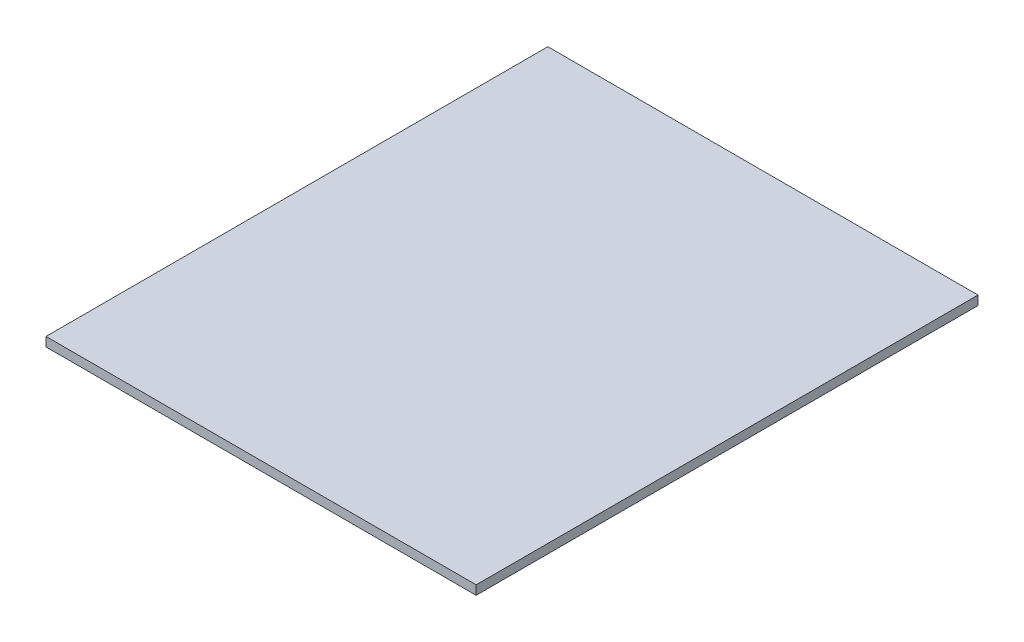
ISO-10303-21;
HEADER;
FILE_DESCRIPTION(('STEP AP214'),'2;1');
FILE_NAME('part.step','',(''),(''),'','','');
FILE_SCHEMA(('AUTOMOTIVE_DESIGN { 1 0 10303 214 1 1 1 1 }'));
ENDSEC;
DATA;
#1=APPLICATION_CONTEXT('core data for automotive mechanical design processes');
#2=APPLICATION_PROTOCOL_DEFINITION('international standard','automotive_design',2000,#1);
#3=PRODUCT_CONTEXT('',#1,'mechanical');
#4=PRODUCT('Part','Part','',(#3));
#5=PRODUCT_RELATED_PRODUCT_CATEGORY('part','',(#4));
#6=PRODUCT_DEFINITION_FORMATION('','',#4);
#7=PRODUCT_DEFINITION_CONTEXT('part definition',#1,'design');
#8=PRODUCT_DEFINITION('design','',#6,#7);
#9=PRODUCT_DEFINITION_SHAPE('','',#8);
#10=(LENGTH_UNIT() NAMED_UNIT(*) SI_UNIT(.MILLI.,.METRE.));
#11=(NAMED_UNIT(*) PLANE_ANGLE_UNIT() SI_UNIT($,.RADIAN.));
#12=(NAMED_UNIT(*) SI_UNIT($,.STERADIAN.) SOLID_ANGLE_UNIT());
#13=UNCERTAINTY_MEASURE_WITH_UNIT(LENGTH_MEASURE(1.E-05),#10,'distance_accuracy_value','');
#14=(GEOMETRIC_REPRESENTATION_CONTEXT(3) GLOBAL_UNCERTAINTY_ASSIGNED_CONTEXT((#13)) GLOBAL_UNIT_ASSIGNED_CONTEXT((#10,
#11,#12)) REPRESENTATION_CONTEXT('',''));
#15=CARTESIAN_POINT('',(0.,0.,0.));
#16=DIRECTION('',(0.,0.,1.));
#17=DIRECTION('',(1.,0.,0.));
#18=AXIS2_PLACEMENT_3D('',#15,#16,#17);
#19=CARTESIAN_POINT('',(-300.,12.7,350.));
#20=DIRECTION('',(1.,0.,0.));
#21=DIRECTION('',(0.,0.,-1.));
#22=AXIS2_PLACEMENT_3D('',#19,#20,#21);
#23=PLANE('',#22);
#24=DIRECTION('',(0.,0.,1.));
#25=VECTOR('',#24,1.);
#26=CARTESIAN_POINT('',(-300.,0.,350.));
#27=LINE('',#26,#25);
#28=CARTESIAN_POINT('',(-300.,0.,-350.));
#29=VERTEX_POINT('',#28);
#30=CARTESIAN_POINT('',(-300.,0.,350.));
#31=VERTEX_POINT('',#30);
#32=EDGE_CURVE('E100',#29,#31,#27,.T.);
#33=ORIENTED_EDGE('',*,*,#32,.T.);
#34=DIRECTION('',(0.,-1.,0.));
#35=VECTOR('',#34,1.);
#36=CARTESIAN_POINT('',(-300.,12.7,350.));
#37=LINE('',#36,#35);
#38=CARTESIAN_POINT('',(-300.,12.7,350.));
#39=VERTEX_POINT('',#38);
#40=EDGE_CURVE('E11',#39,#31,#37,.T.);
#41=ORIENTED_EDGE('',*,*,#40,.F.);
#42=DIRECTION('',(0.,0.,1.));
#43=VECTOR('',#42,1.);
#44=CARTESIAN_POINT('',(-300.,12.7,350.));
#45=LINE('',#44,#43);
#46=CARTESIAN_POINT('',(-300.,12.7,-350.));
#47=VERTEX_POINT('',#46);
#48=EDGE_CURVE('E88',#47,#39,#45,.T.);
#49=ORIENTED_EDGE('',*,*,#48,.F.);
#50=DIRECTION('',(0.,-1.,0.));
#51=VECTOR('',#50,1.);
#52=CARTESIAN_POINT('',(-300.,12.7,-350.));
#53=LINE('',#52,#51);
#54=EDGE_CURVE('E96',#47,#29,#53,.T.);
#55=ORIENTED_EDGE('',*,*,#54,.T.);
#56=EDGE_LOOP('',(#33,#41,#49,#55));
#57=FACE_BOUND('',#56,.T.);
#58=ADVANCED_FACE('F37',(#57),#23,.F.);
#59=CARTESIAN_POINT('',(300.,12.7,350.));
#60=DIRECTION('',(0.,0.,-1.));
#61=DIRECTION('',(-1.,0.,0.));
#62=AXIS2_PLACEMENT_3D('',#59,#60,#61);
#63=PLANE('',#62);
#64=DIRECTION('',(1.,0.,0.));
#65=VECTOR('',#64,1.);
#66=CARTESIAN_POINT('',(300.,0.,350.));
#67=LINE('',#66,#65);
#68=CARTESIAN_POINT('',(300.,0.,350.));
#69=VERTEX_POINT('',#68);
#70=EDGE_CURVE('E92',#31,#69,#67,.T.);
#71=ORIENTED_EDGE('',*,*,#70,.T.);
#72=DIRECTION('',(0.,-1.,0.));
#73=VECTOR('',#72,1.);
#74=CARTESIAN_POINT('',(300.,12.7,350.));
#75=LINE('',#74,#73);
#76=CARTESIAN_POINT('',(300.,12.7,350.));
#77=VERTEX_POINT('',#76);
#78=EDGE_CURVE('E45',#77,#69,#75,.T.);
#79=ORIENTED_EDGE('',*,*,#78,.F.);
#80=DIRECTION('',(1.,0.,0.));
#81=VECTOR('',#80,1.);
#82=CARTESIAN_POINT('',(300.,12.7,350.));
#83=LINE('',#82,#81);
#84=EDGE_CURVE('E83',#39,#77,#83,.T.);
#85=ORIENTED_EDGE('',*,*,#84,.F.);
#86=ORIENTED_EDGE('',*,*,#40,.T.);
#87=EDGE_LOOP('',(#71,#79,#85,#86));
#88=FACE_BOUND('',#87,.T.);
#89=ADVANCED_FACE('F91',(#88),#63,.F.);
#90=CARTESIAN_POINT('',(300.,12.7,350.));
#91=DIRECTION('',(-1.,0.,0.));
#92=DIRECTION('',(0.,0.,1.));
#93=AXIS2_PLACEMENT_3D('',#90,#91,#92);
#94=PLANE('',#93);
#95=DIRECTION('',(0.,0.,-1.));
#96=VECTOR('',#95,1.);
#97=CARTESIAN_POINT('',(300.,0.,350.));
#98=LINE('',#97,#96);
#99=CARTESIAN_POINT('',(300.,0.,-350.));
#100=VERTEX_POINT('',#99);
#101=EDGE_CURVE('E70',#69,#100,#98,.T.);
#102=ORIENTED_EDGE('',*,*,#101,.T.);
#103=DIRECTION('',(0.,-1.,0.));
#104=VECTOR('',#103,1.);
#105=CARTESIAN_POINT('',(300.,12.7,-350.));
#106=LINE('',#105,#104);
#107=CARTESIAN_POINT('',(300.,12.7,-350.));
#108=VERTEX_POINT('',#107);
#109=EDGE_CURVE('E93',#108,#100,#106,.T.);
#110=ORIENTED_EDGE('',*,*,#109,.F.);
#111=DIRECTION('',(0.,0.,-1.));
#112=VECTOR('',#111,1.);
#113=CARTESIAN_POINT('',(300.,12.7,350.));
#114=LINE('',#113,#112);
#115=EDGE_CURVE('E86',#77,#108,#114,.T.);
#116=ORIENTED_EDGE('',*,*,#115,.F.);
#117=ORIENTED_EDGE('',*,*,#78,.T.);
#118=EDGE_LOOP('',(#102,#110,#116,#117));
#119=FACE_BOUND('',#118,.T.);
#120=ADVANCED_FACE('F94',(#119),#94,.F.);
#121=CARTESIAN_POINT('',(300.,12.7,-350.));
#122=DIRECTION('',(0.,0.,1.));
#123=DIRECTION('',(1.,0.,0.));
#124=AXIS2_PLACEMENT_3D('',#121,#122,#123);
#125=PLANE('',#124);
#126=DIRECTION('',(-1.,0.,0.));
#127=VECTOR('',#126,1.);
#128=CARTESIAN_POINT('',(300.,0.,-350.));
#129=LINE('',#128,#127);
#130=EDGE_CURVE('E76',#100,#29,#129,.T.);
#131=ORIENTED_EDGE('',*,*,#130,.T.);
#132=ORIENTED_EDGE('',*,*,#54,.F.);
#133=DIRECTION('',(-1.,0.,0.));
#134=VECTOR('',#133,1.);
#135=CARTESIAN_POINT('',(300.,12.7,-350.));
#136=LINE('',#135,#134);
#137=EDGE_CURVE('E53',#108,#47,#136,.T.);
#138=ORIENTED_EDGE('',*,*,#137,.F.);
#139=ORIENTED_EDGE('',*,*,#109,.T.);
#140=EDGE_LOOP('',(#131,#132,#138,#139));
#141=FACE_BOUND('',#140,.T.);
#142=ADVANCED_FACE('F107',(#141),#125,.F.);
#143=CARTESIAN_POINT('',(0.,12.7,0.));
#144=DIRECTION('',(0.,1.,0.));
#145=DIRECTION('',(0.,0.,1.));
#146=AXIS2_PLACEMENT_3D('',#143,#144,#145);
#147=PLANE('',#146);
#148=ORIENTED_EDGE('',*,*,#48,.T.);
#149=ORIENTED_EDGE('',*,*,#84,.T.);
#150=ORIENTED_EDGE('',*,*,#115,.T.);
#151=ORIENTED_EDGE('',*,*,#137,.T.);
#152=EDGE_LOOP('',(#148,#149,#150,#151));
#153=FACE_BOUND('',#152,.T.);
#154=ADVANCED_FACE('F84',(#153),#147,.T.);
#155=CARTESIAN_POINT('',(0.,0.,0.));
#156=DIRECTION('',(0.,1.,0.));
#157=DIRECTION('',(0.,0.,1.));
#158=AXIS2_PLACEMENT_3D('',#155,#156,#157);
#159=PLANE('',#158);
#160=ORIENTED_EDGE('',*,*,#32,.F.);
#161=ORIENTED_EDGE('',*,*,#130,.F.);
#162=ORIENTED_EDGE('',*,*,#101,.F.);
#163=ORIENTED_EDGE('',*,*,#70,.F.);
#164=EDGE_LOOP('',(#160,#161,#162,#163));
#165=FACE_BOUND('',#164,.T.);
#166=ADVANCED_FACE('F110',(#165),#159,.F.);
#167=CLOSED_SHELL('',(#58,#89,#120,#142,#154,#166));
#168=MANIFOLD_SOLID_BREP('B2',#167);
#169=ADVANCED_BREP_SHAPE_REPRESENTATION('',(#18,#168),#14);
#170=SHAPE_DEFINITION_REPRESENTATION(#9,#169);
ENDSEC;
END-ISO-10303-21;
